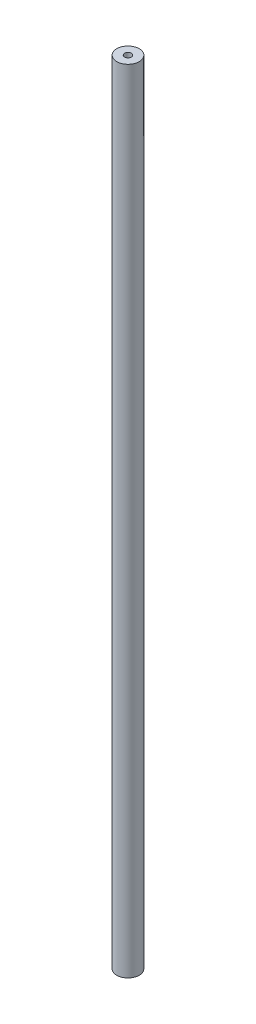
ISO-10303-21;
HEADER;
FILE_DESCRIPTION(('STEP AP214'),'2;1');
FILE_NAME('part.step','',(''),(''),'','','');
FILE_SCHEMA(('AUTOMOTIVE_DESIGN { 1 0 10303 214 1 1 1 1 }'));
ENDSEC;
DATA;
#1=APPLICATION_CONTEXT('core data for automotive mechanical design processes');
#2=APPLICATION_PROTOCOL_DEFINITION('international standard','automotive_design',2000,#1);
#3=PRODUCT_CONTEXT('',#1,'mechanical');
#4=PRODUCT('Part','Part','',(#3));
#5=PRODUCT_RELATED_PRODUCT_CATEGORY('part','',(#4));
#6=PRODUCT_DEFINITION_FORMATION('','',#4);
#7=PRODUCT_DEFINITION_CONTEXT('part definition',#1,'design');
#8=PRODUCT_DEFINITION('design','',#6,#7);
#9=PRODUCT_DEFINITION_SHAPE('','',#8);
#10=(LENGTH_UNIT() NAMED_UNIT(*) SI_UNIT(.MILLI.,.METRE.));
#11=(NAMED_UNIT(*) PLANE_ANGLE_UNIT() SI_UNIT($,.RADIAN.));
#12=(NAMED_UNIT(*) SI_UNIT($,.STERADIAN.) SOLID_ANGLE_UNIT());
#13=UNCERTAINTY_MEASURE_WITH_UNIT(LENGTH_MEASURE(1.E-05),#10,'distance_accuracy_value','');
#14=(GEOMETRIC_REPRESENTATION_CONTEXT(3) GLOBAL_UNCERTAINTY_ASSIGNED_CONTEXT((#13)) GLOBAL_UNIT_ASSIGNED_CONTEXT((#10,
#11,#12)) REPRESENTATION_CONTEXT('',''));
#15=CARTESIAN_POINT('',(0.,0.,0.));
#16=DIRECTION('',(0.,0.,1.));
#17=DIRECTION('',(1.,0.,0.));
#18=AXIS2_PLACEMENT_3D('',#15,#16,#17);
#19=CARTESIAN_POINT('',(0.,353.,0.));
#20=DIRECTION('',(0.,-1.,0.));
#21=DIRECTION('',(0.,0.,-1.));
#22=AXIS2_PLACEMENT_3D('',#19,#20,#21);
#23=CYLINDRICAL_SURFACE('',#22,5.);
#24=CARTESIAN_POINT('',(0.,353.,0.));
#25=DIRECTION('',(0.,1.,0.));
#26=DIRECTION('',(0.,0.,1.));
#27=AXIS2_PLACEMENT_3D('',#24,#25,#26);
#28=CIRCLE('',#27,5.);
#29=CARTESIAN_POINT('',(0.,353.,5.));
#30=VERTEX_POINT('',#29);
#31=EDGE_CURVE('E10',#30,#30,#28,.T.);
#32=ORIENTED_EDGE('',*,*,#31,.F.);
#33=EDGE_LOOP('',(#32));
#34=FACE_BOUND('',#33,.T.);
#35=CARTESIAN_POINT('',(0.,0.,0.));
#36=DIRECTION('',(0.,1.,0.));
#37=DIRECTION('',(0.,0.,1.));
#38=AXIS2_PLACEMENT_3D('',#35,#36,#37);
#39=CIRCLE('',#38,5.);
#40=CARTESIAN_POINT('',(0.,0.,5.));
#41=VERTEX_POINT('',#40);
#42=EDGE_CURVE('E33',#41,#41,#39,.T.);
#43=ORIENTED_EDGE('',*,*,#42,.T.);
#44=EDGE_LOOP('',(#43));
#45=FACE_BOUND('',#44,.T.);
#46=ADVANCED_FACE('F30',(#34,#45),#23,.T.);
#47=CARTESIAN_POINT('',(0.,353.,0.));
#48=DIRECTION('',(0.,1.,0.));
#49=DIRECTION('',(0.,0.,1.));
#50=AXIS2_PLACEMENT_3D('',#47,#48,#49);
#51=PLANE('',#50);
#52=CARTESIAN_POINT('',(0.,353.,0.));
#53=DIRECTION('',(0.,1.,0.));
#54=DIRECTION('',(0.,0.,1.));
#55=AXIS2_PLACEMENT_3D('',#52,#53,#54);
#56=CIRCLE('',#55,1.5);
#57=CARTESIAN_POINT('',(0.,353.,1.5));
#58=VERTEX_POINT('',#57);
#59=EDGE_CURVE('E42',#58,#58,#56,.T.);
#60=ORIENTED_EDGE('',*,*,#59,.F.);
#61=EDGE_LOOP('',(#60));
#62=FACE_BOUND('',#61,.T.);
#63=ORIENTED_EDGE('',*,*,#31,.T.);
#64=EDGE_LOOP('',(#63));
#65=FACE_BOUND('',#64,.T.);
#66=ADVANCED_FACE('F57',(#62,#65),#51,.T.);
#67=CARTESIAN_POINT('',(0.,0.,0.));
#68=DIRECTION('',(0.,1.,0.));
#69=DIRECTION('',(0.,0.,1.));
#70=AXIS2_PLACEMENT_3D('',#67,#68,#69);
#71=PLANE('',#70);
#72=ORIENTED_EDGE('',*,*,#42,.F.);
#73=EDGE_LOOP('',(#72));
#74=FACE_BOUND('',#73,.T.);
#75=ADVANCED_FACE('F53',(#74),#71,.F.);
#76=CARTESIAN_POINT('',(0.,343.,0.));
#77=DIRECTION('',(0.,1.,0.));
#78=DIRECTION('',(0.,0.,1.));
#79=AXIS2_PLACEMENT_3D('',#76,#77,#78);
#80=CYLINDRICAL_SURFACE('',#79,1.5);
#81=CARTESIAN_POINT('',(0.,343.,0.));
#82=DIRECTION('',(0.,1.,0.));
#83=DIRECTION('',(0.,0.,1.));
#84=AXIS2_PLACEMENT_3D('',#81,#82,#83);
#85=CIRCLE('',#84,1.5);
#86=CARTESIAN_POINT('',(0.,343.,1.5));
#87=VERTEX_POINT('',#86);
#88=EDGE_CURVE('E40',#87,#87,#85,.T.);
#89=ORIENTED_EDGE('',*,*,#88,.F.);
#90=EDGE_LOOP('',(#89));
#91=FACE_BOUND('',#90,.T.);
#92=ORIENTED_EDGE('',*,*,#59,.T.);
#93=EDGE_LOOP('',(#92));
#94=FACE_BOUND('',#93,.T.);
#95=ADVANCED_FACE('F50',(#91,#94),#80,.F.);
#96=CARTESIAN_POINT('',(0.,343.,0.));
#97=DIRECTION('',(0.,1.,0.));
#98=DIRECTION('',(0.,0.,1.));
#99=AXIS2_PLACEMENT_3D('',#96,#97,#98);
#100=PLANE('',#99);
#101=ORIENTED_EDGE('',*,*,#88,.T.);
#102=EDGE_LOOP('',(#101));
#103=FACE_BOUND('',#102,.T.);
#104=ADVANCED_FACE('F48',(#103),#100,.T.);
#105=CLOSED_SHELL('',(#46,#66,#75,#95,#104));
#106=MANIFOLD_SOLID_BREP('B2',#105);
#107=ADVANCED_BREP_SHAPE_REPRESENTATION('',(#18,#106),#14);
#108=SHAPE_DEFINITION_REPRESENTATION(#9,#107);
ENDSEC;
END-ISO-10303-21;
